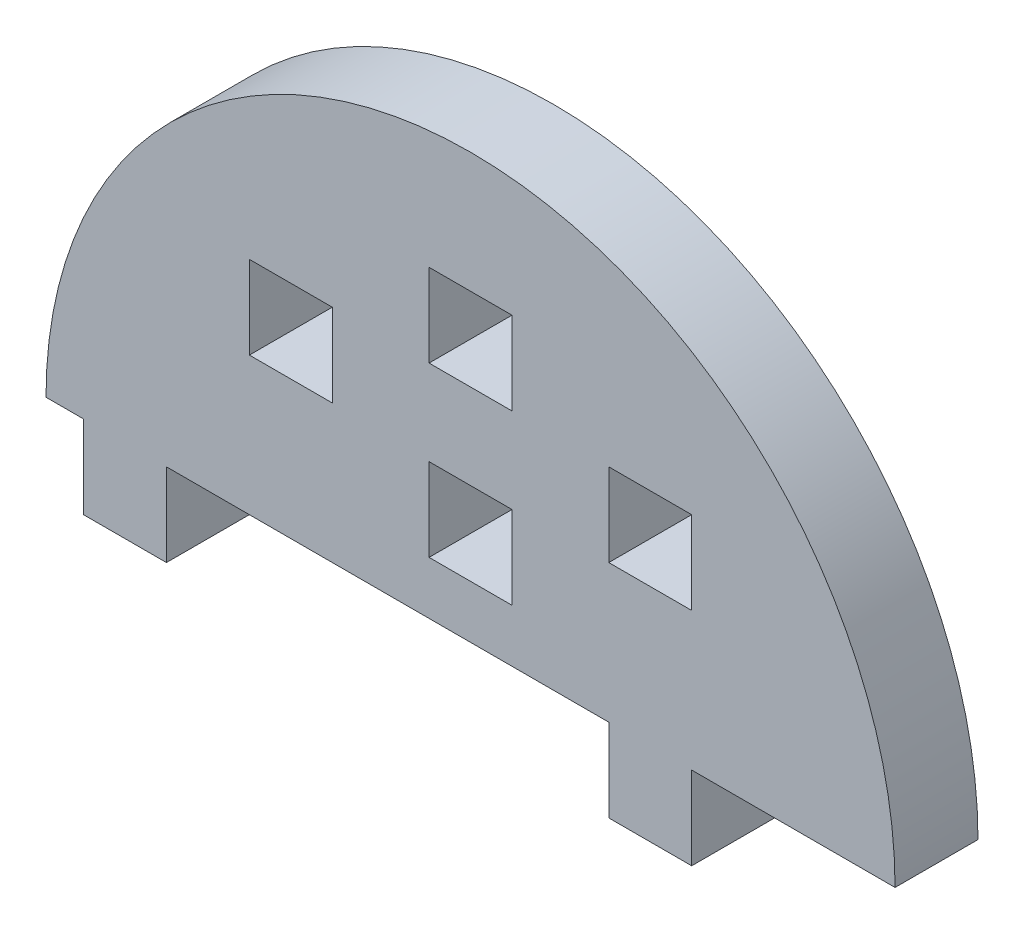
ISO-10303-21;
HEADER;
FILE_DESCRIPTION(('STEP AP214'),'2;1');
FILE_NAME('part.step','',(''),(''),'','','');
FILE_SCHEMA(('AUTOMOTIVE_DESIGN { 1 0 10303 214 1 1 1 1 }'));
ENDSEC;
DATA;
#1=APPLICATION_CONTEXT('core data for automotive mechanical design processes');
#2=APPLICATION_PROTOCOL_DEFINITION('international standard','automotive_design',2000,#1);
#3=PRODUCT_CONTEXT('',#1,'mechanical');
#4=PRODUCT('Part','Part','',(#3));
#5=PRODUCT_RELATED_PRODUCT_CATEGORY('part','',(#4));
#6=PRODUCT_DEFINITION_FORMATION('','',#4);
#7=PRODUCT_DEFINITION_CONTEXT('part definition',#1,'design');
#8=PRODUCT_DEFINITION('design','',#6,#7);
#9=PRODUCT_DEFINITION_SHAPE('','',#8);
#10=(LENGTH_UNIT() NAMED_UNIT(*) SI_UNIT(.MILLI.,.METRE.));
#11=(NAMED_UNIT(*) PLANE_ANGLE_UNIT() SI_UNIT($,.RADIAN.));
#12=(NAMED_UNIT(*) SI_UNIT($,.STERADIAN.) SOLID_ANGLE_UNIT());
#13=UNCERTAINTY_MEASURE_WITH_UNIT(LENGTH_MEASURE(1.E-05),#10,'distance_accuracy_value','');
#14=(GEOMETRIC_REPRESENTATION_CONTEXT(3) GLOBAL_UNCERTAINTY_ASSIGNED_CONTEXT((#13)) GLOBAL_UNIT_ASSIGNED_CONTEXT((#10,
#11,#12)) REPRESENTATION_CONTEXT('',''));
#15=CARTESIAN_POINT('',(0.,0.,0.));
#16=DIRECTION('',(0.,0.,1.));
#17=DIRECTION('',(1.,0.,0.));
#18=AXIS2_PLACEMENT_3D('',#15,#16,#17);
#19=CARTESIAN_POINT('',(3671.8002761947,1334.92871189316,6.));
#20=DIRECTION('',(0.,0.,1.));
#21=DIRECTION('',(1.,0.,0.));
#22=AXIS2_PLACEMENT_3D('',#19,#20,#21);
#23=PLANE('',#22);
#24=DIRECTION('',(0.,1.,0.));
#25=VECTOR('',#24,1.);
#26=CARTESIAN_POINT('',(3681.8002761947,0.,6.));
#27=LINE('',#26,#25);
#28=CARTESIAN_POINT('',(3681.8002761947,1344.92871189316,6.));
#29=VERTEX_POINT('',#28);
#30=CARTESIAN_POINT('',(3681.8002761947,1350.92871189316,6.));
#31=VERTEX_POINT('',#30);
#32=EDGE_CURVE('E393',#29,#31,#27,.T.);
#33=ORIENTED_EDGE('',*,*,#32,.T.);
#34=DIRECTION('',(1.,0.,0.));
#35=VECTOR('',#34,1.);
#36=CARTESIAN_POINT('',(0.,1350.92871189316,6.));
#37=LINE('',#36,#35);
#38=CARTESIAN_POINT('',(3687.8002761947,1350.92871189316,6.));
#39=VERTEX_POINT('',#38);
#40=EDGE_CURVE('E406',#31,#39,#37,.T.);
#41=ORIENTED_EDGE('',*,*,#40,.T.);
#42=DIRECTION('',(0.,-1.,0.));
#43=VECTOR('',#42,1.);
#44=CARTESIAN_POINT('',(3687.8002761947,0.,6.));
#45=LINE('',#44,#43);
#46=CARTESIAN_POINT('',(3687.8002761947,1344.92871189316,6.));
#47=VERTEX_POINT('',#46);
#48=EDGE_CURVE('E223',#39,#47,#45,.T.);
#49=ORIENTED_EDGE('',*,*,#48,.T.);
#50=DIRECTION('',(-1.,0.,0.));
#51=VECTOR('',#50,1.);
#52=CARTESIAN_POINT('',(0.,1344.92871189316,6.));
#53=LINE('',#52,#51);
#54=EDGE_CURVE('E385',#47,#29,#53,.T.);
#55=ORIENTED_EDGE('',*,*,#54,.T.);
#56=EDGE_LOOP('',(#33,#41,#49,#55));
#57=FACE_BOUND('',#56,.T.);
#58=DIRECTION('',(0.,1.,0.));
#59=VECTOR('',#58,1.);
#60=CARTESIAN_POINT('',(3668.8002761947,0.,6.));
#61=LINE('',#60,#59);
#62=CARTESIAN_POINT('',(3668.8002761947,1350.92871189316,6.));
#63=VERTEX_POINT('',#62);
#64=CARTESIAN_POINT('',(3668.8002761947,1356.92871189316,6.));
#65=VERTEX_POINT('',#64);
#66=EDGE_CURVE('E472',#63,#65,#61,.T.);
#67=ORIENTED_EDGE('',*,*,#66,.T.);
#68=DIRECTION('',(1.,0.,0.));
#69=VECTOR('',#68,1.);
#70=CARTESIAN_POINT('',(0.,1356.92871189316,6.));
#71=LINE('',#70,#69);
#72=CARTESIAN_POINT('',(3674.8002761947,1356.92871189316,6.));
#73=VERTEX_POINT('',#72);
#74=EDGE_CURVE('E485',#65,#73,#71,.T.);
#75=ORIENTED_EDGE('',*,*,#74,.T.);
#76=DIRECTION('',(0.,-1.,0.));
#77=VECTOR('',#76,1.);
#78=CARTESIAN_POINT('',(3674.8002761947,0.,6.));
#79=LINE('',#78,#77);
#80=CARTESIAN_POINT('',(3674.8002761947,1350.92871189316,6.));
#81=VERTEX_POINT('',#80);
#82=EDGE_CURVE('E481',#73,#81,#79,.T.);
#83=ORIENTED_EDGE('',*,*,#82,.T.);
#84=DIRECTION('',(-1.,0.,0.));
#85=VECTOR('',#84,1.);
#86=CARTESIAN_POINT('',(0.,1350.92871189316,6.));
#87=LINE('',#86,#85);
#88=EDGE_CURVE('E476',#81,#63,#87,.T.);
#89=ORIENTED_EDGE('',*,*,#88,.T.);
#90=EDGE_LOOP('',(#67,#75,#83,#89));
#91=FACE_BOUND('',#90,.T.);
#92=DIRECTION('',(1.,0.,0.));
#93=VECTOR('',#92,1.);
#94=CARTESIAN_POINT('',(3687.8002761947,1334.92871189316,6.));
#95=LINE('',#94,#93);
#96=CARTESIAN_POINT('',(3687.8002761947,1334.92871189316,6.));
#97=VERTEX_POINT('',#96);
#98=CARTESIAN_POINT('',(3702.51456190899,1334.92871189316,6.));
#99=VERTEX_POINT('',#98);
#100=EDGE_CURVE('E559',#97,#99,#95,.T.);
#101=ORIENTED_EDGE('',*,*,#100,.T.);
#102=CARTESIAN_POINT('',(3671.8002761947,1334.92871189316,6.));
#103=DIRECTION('',(0.,0.,1.));
#104=DIRECTION('',(1.,0.,0.));
#105=AXIS2_PLACEMENT_3D('',#102,#103,#104);
#106=CIRCLE('',#105,30.7142857142879);
#107=CARTESIAN_POINT('',(3641.08599048041,1334.92871189316,6.));
#108=VERTEX_POINT('',#107);
#109=EDGE_CURVE('E563',#99,#108,#106,.T.);
#110=ORIENTED_EDGE('',*,*,#109,.T.);
#111=DIRECTION('',(1.,0.,0.));
#112=VECTOR('',#111,1.);
#113=CARTESIAN_POINT('',(3641.08599048041,1334.92871189316,6.));
#114=LINE('',#113,#112);
#115=CARTESIAN_POINT('',(3643.8002761947,1334.92871189316,6.));
#116=VERTEX_POINT('',#115);
#117=EDGE_CURVE('E567',#108,#116,#114,.T.);
#118=ORIENTED_EDGE('',*,*,#117,.T.);
#119=DIRECTION('',(0.,1.,0.));
#120=VECTOR('',#119,1.);
#121=CARTESIAN_POINT('',(3643.8002761947,1328.92871189316,6.));
#122=LINE('',#121,#120);
#123=CARTESIAN_POINT('',(3643.8002761947,1328.92871189316,6.));
#124=VERTEX_POINT('',#123);
#125=EDGE_CURVE('E570',#124,#116,#122,.T.);
#126=ORIENTED_EDGE('',*,*,#125,.F.);
#127=DIRECTION('',(-1.,0.,0.));
#128=VECTOR('',#127,1.);
#129=CARTESIAN_POINT('',(3649.8002761947,1328.92871189316,6.));
#130=LINE('',#129,#128);
#131=CARTESIAN_POINT('',(3649.8002761947,1328.92871189316,6.));
#132=VERTEX_POINT('',#131);
#133=EDGE_CURVE('E574',#132,#124,#130,.T.);
#134=ORIENTED_EDGE('',*,*,#133,.F.);
#135=DIRECTION('',(0.,-1.,0.));
#136=VECTOR('',#135,1.);
#137=CARTESIAN_POINT('',(3649.8002761947,1334.92871189316,6.));
#138=LINE('',#137,#136);
#139=CARTESIAN_POINT('',(3649.8002761947,1334.92871189316,6.));
#140=VERTEX_POINT('',#139);
#141=EDGE_CURVE('E578',#140,#132,#138,.T.);
#142=ORIENTED_EDGE('',*,*,#141,.F.);
#143=DIRECTION('',(1.,0.,0.));
#144=VECTOR('',#143,1.);
#145=CARTESIAN_POINT('',(3649.8002761947,1334.92871189316,6.));
#146=LINE('',#145,#144);
#147=CARTESIAN_POINT('',(3681.8002761947,1334.92871189316,6.));
#148=VERTEX_POINT('',#147);
#149=EDGE_CURVE('E582',#140,#148,#146,.T.);
#150=ORIENTED_EDGE('',*,*,#149,.T.);
#151=DIRECTION('',(0.,-1.,0.));
#152=VECTOR('',#151,1.);
#153=CARTESIAN_POINT('',(3681.8002761947,1334.92871189316,6.));
#154=LINE('',#153,#152);
#155=CARTESIAN_POINT('',(3681.8002761947,1328.92871189316,6.));
#156=VERTEX_POINT('',#155);
#157=EDGE_CURVE('E585',#148,#156,#154,.T.);
#158=ORIENTED_EDGE('',*,*,#157,.T.);
#159=DIRECTION('',(1.,0.,0.));
#160=VECTOR('',#159,1.);
#161=CARTESIAN_POINT('',(3681.8002761947,1328.92871189316,6.));
#162=LINE('',#161,#160);
#163=CARTESIAN_POINT('',(3687.8002761947,1328.92871189316,6.));
#164=VERTEX_POINT('',#163);
#165=EDGE_CURVE('E588',#156,#164,#162,.T.);
#166=ORIENTED_EDGE('',*,*,#165,.T.);
#167=DIRECTION('',(0.,1.,0.));
#168=VECTOR('',#167,1.);
#169=CARTESIAN_POINT('',(3687.8002761947,1328.92871189316,6.));
#170=LINE('',#169,#168);
#171=EDGE_CURVE('E591',#164,#97,#170,.T.);
#172=ORIENTED_EDGE('',*,*,#171,.T.);
#173=EDGE_LOOP('',(#101,#110,#118,#126,#134,#142,#150,#158,#166,#172));
#174=FACE_BOUND('',#173,.T.);
#175=DIRECTION('',(0.,1.,0.));
#176=VECTOR('',#175,1.);
#177=CARTESIAN_POINT('',(3661.8002761947,0.,6.));
#178=LINE('',#177,#176);
#179=CARTESIAN_POINT('',(3661.8002761947,1344.92871189316,6.));
#180=VERTEX_POINT('',#179);
#181=CARTESIAN_POINT('',(3661.8002761947,1350.92871189316,6.));
#182=VERTEX_POINT('',#181);
#183=EDGE_CURVE('E519',#180,#182,#178,.T.);
#184=ORIENTED_EDGE('',*,*,#183,.F.);
#185=DIRECTION('',(1.,0.,0.));
#186=VECTOR('',#185,1.);
#187=CARTESIAN_POINT('',(0.,1344.92871189316,6.));
#188=LINE('',#187,#186);
#189=CARTESIAN_POINT('',(3655.8002761947,1344.92871189316,6.));
#190=VERTEX_POINT('',#189);
#191=EDGE_CURVE('E516',#190,#180,#188,.T.);
#192=ORIENTED_EDGE('',*,*,#191,.F.);
#193=DIRECTION('',(0.,-1.,0.));
#194=VECTOR('',#193,1.);
#195=CARTESIAN_POINT('',(3655.8002761947,0.,6.));
#196=LINE('',#195,#194);
#197=CARTESIAN_POINT('',(3655.8002761947,1350.92871189316,6.));
#198=VERTEX_POINT('',#197);
#199=EDGE_CURVE('E527',#198,#190,#196,.T.);
#200=ORIENTED_EDGE('',*,*,#199,.F.);
#201=DIRECTION('',(-1.,0.,0.));
#202=VECTOR('',#201,1.);
#203=CARTESIAN_POINT('',(0.,1350.92871189316,6.));
#204=LINE('',#203,#202);
#205=EDGE_CURVE('E523',#182,#198,#204,.T.);
#206=ORIENTED_EDGE('',*,*,#205,.F.);
#207=EDGE_LOOP('',(#184,#192,#200,#206));
#208=FACE_BOUND('',#207,.T.);
#209=DIRECTION('',(0.,-1.,0.));
#210=VECTOR('',#209,1.);
#211=CARTESIAN_POINT('',(3668.8002761947,0.,6.));
#212=LINE('',#211,#210);
#213=CARTESIAN_POINT('',(3668.8002761947,1344.75317072658,6.));
#214=VERTEX_POINT('',#213);
#215=CARTESIAN_POINT('',(3668.8002761947,1338.75317072658,6.));
#216=VERTEX_POINT('',#215);
#217=EDGE_CURVE('E432',#214,#216,#212,.T.);
#218=ORIENTED_EDGE('',*,*,#217,.F.);
#219=DIRECTION('',(-1.,0.,0.));
#220=VECTOR('',#219,1.);
#221=CARTESIAN_POINT('',(0.,1344.75317072658,6.));
#222=LINE('',#221,#220);
#223=CARTESIAN_POINT('',(3674.8002761947,1344.75317072658,6.));
#224=VERTEX_POINT('',#223);
#225=EDGE_CURVE('E429',#224,#214,#222,.T.);
#226=ORIENTED_EDGE('',*,*,#225,.F.);
#227=DIRECTION('',(0.,1.,0.));
#228=VECTOR('',#227,1.);
#229=CARTESIAN_POINT('',(3674.8002761947,0.,6.));
#230=LINE('',#229,#228);
#231=CARTESIAN_POINT('',(3674.8002761947,1338.75317072658,6.));
#232=VERTEX_POINT('',#231);
#233=EDGE_CURVE('E440',#232,#224,#230,.T.);
#234=ORIENTED_EDGE('',*,*,#233,.F.);
#235=DIRECTION('',(1.,0.,0.));
#236=VECTOR('',#235,1.);
#237=CARTESIAN_POINT('',(0.,1338.75317072658,6.));
#238=LINE('',#237,#236);
#239=EDGE_CURVE('E436',#216,#232,#238,.T.);
#240=ORIENTED_EDGE('',*,*,#239,.F.);
#241=EDGE_LOOP('',(#218,#226,#234,#240));
#242=FACE_BOUND('',#241,.T.);
#243=ADVANCED_FACE('F207',(#57,#91,#174,#208,#242),#23,.T.);
#244=CARTESIAN_POINT('',(3671.8002761947,1334.92871189316,0.));
#245=DIRECTION('',(0.,0.,1.));
#246=DIRECTION('',(1.,0.,0.));
#247=AXIS2_PLACEMENT_3D('',#244,#245,#246);
#248=PLANE('',#247);
#249=DIRECTION('',(1.,0.,0.));
#250=VECTOR('',#249,1.);
#251=CARTESIAN_POINT('',(0.,1350.92871189316,0.));
#252=LINE('',#251,#250);
#253=CARTESIAN_POINT('',(3681.8002761947,1350.92871189316,0.));
#254=VERTEX_POINT('',#253);
#255=CARTESIAN_POINT('',(3687.8002761947,1350.92871189316,0.));
#256=VERTEX_POINT('',#255);
#257=EDGE_CURVE('E400',#254,#256,#252,.T.);
#258=ORIENTED_EDGE('',*,*,#257,.F.);
#259=DIRECTION('',(0.,1.,0.));
#260=VECTOR('',#259,1.);
#261=CARTESIAN_POINT('',(3681.8002761947,0.,0.));
#262=LINE('',#261,#260);
#263=CARTESIAN_POINT('',(3681.8002761947,1344.92871189316,0.));
#264=VERTEX_POINT('',#263);
#265=EDGE_CURVE('E231',#264,#254,#262,.T.);
#266=ORIENTED_EDGE('',*,*,#265,.F.);
#267=DIRECTION('',(-1.,0.,0.));
#268=VECTOR('',#267,1.);
#269=CARTESIAN_POINT('',(0.,1344.92871189316,0.));
#270=LINE('',#269,#268);
#271=CARTESIAN_POINT('',(3687.8002761947,1344.92871189316,0.));
#272=VERTEX_POINT('',#271);
#273=EDGE_CURVE('E387',#272,#264,#270,.T.);
#274=ORIENTED_EDGE('',*,*,#273,.F.);
#275=DIRECTION('',(0.,-1.,0.));
#276=VECTOR('',#275,1.);
#277=CARTESIAN_POINT('',(3687.8002761947,0.,0.));
#278=LINE('',#277,#276);
#279=EDGE_CURVE('E415',#256,#272,#278,.T.);
#280=ORIENTED_EDGE('',*,*,#279,.F.);
#281=EDGE_LOOP('',(#258,#266,#274,#280));
#282=FACE_BOUND('',#281,.T.);
#283=DIRECTION('',(1.,0.,0.));
#284=VECTOR('',#283,1.);
#285=CARTESIAN_POINT('',(0.,1344.92871189316,0.));
#286=LINE('',#285,#284);
#287=CARTESIAN_POINT('',(3655.8002761947,1344.92871189316,0.));
#288=VERTEX_POINT('',#287);
#289=CARTESIAN_POINT('',(3661.8002761947,1344.92871189316,0.));
#290=VERTEX_POINT('',#289);
#291=EDGE_CURVE('E515',#288,#290,#286,.T.);
#292=ORIENTED_EDGE('',*,*,#291,.T.);
#293=DIRECTION('',(0.,1.,0.));
#294=VECTOR('',#293,1.);
#295=CARTESIAN_POINT('',(3661.8002761947,0.,0.));
#296=LINE('',#295,#294);
#297=CARTESIAN_POINT('',(3661.8002761947,1350.92871189316,0.));
#298=VERTEX_POINT('',#297);
#299=EDGE_CURVE('E534',#290,#298,#296,.T.);
#300=ORIENTED_EDGE('',*,*,#299,.T.);
#301=DIRECTION('',(-1.,0.,0.));
#302=VECTOR('',#301,1.);
#303=CARTESIAN_POINT('',(0.,1350.92871189316,0.));
#304=LINE('',#303,#302);
#305=CARTESIAN_POINT('',(3655.8002761947,1350.92871189316,0.));
#306=VERTEX_POINT('',#305);
#307=EDGE_CURVE('E538',#298,#306,#304,.T.);
#308=ORIENTED_EDGE('',*,*,#307,.T.);
#309=DIRECTION('',(0.,-1.,0.));
#310=VECTOR('',#309,1.);
#311=CARTESIAN_POINT('',(3655.8002761947,0.,0.));
#312=LINE('',#311,#310);
#313=EDGE_CURVE('E520',#306,#288,#312,.T.);
#314=ORIENTED_EDGE('',*,*,#313,.T.);
#315=EDGE_LOOP('',(#292,#300,#308,#314));
#316=FACE_BOUND('',#315,.T.);
#317=DIRECTION('',(1.,0.,0.));
#318=VECTOR('',#317,1.);
#319=CARTESIAN_POINT('',(3687.8002761947,1334.92871189316,0.));
#320=LINE('',#319,#318);
#321=CARTESIAN_POINT('',(3687.8002761947,1334.92871189316,0.));
#322=VERTEX_POINT('',#321);
#323=CARTESIAN_POINT('',(3702.51456190899,1334.92871189316,0.));
#324=VERTEX_POINT('',#323);
#325=EDGE_CURVE('E558',#322,#324,#320,.T.);
#326=ORIENTED_EDGE('',*,*,#325,.F.);
#327=DIRECTION('',(0.,1.,0.));
#328=VECTOR('',#327,1.);
#329=CARTESIAN_POINT('',(3687.8002761947,1328.92871189316,0.));
#330=LINE('',#329,#328);
#331=CARTESIAN_POINT('',(3687.8002761947,1328.92871189316,0.));
#332=VERTEX_POINT('',#331);
#333=EDGE_CURVE('E564',#332,#322,#330,.T.);
#334=ORIENTED_EDGE('',*,*,#333,.F.);
#335=DIRECTION('',(1.,0.,0.));
#336=VECTOR('',#335,1.);
#337=CARTESIAN_POINT('',(3681.8002761947,1328.92871189316,0.));
#338=LINE('',#337,#336);
#339=CARTESIAN_POINT('',(3681.8002761947,1328.92871189316,0.));
#340=VERTEX_POINT('',#339);
#341=EDGE_CURVE('E623',#340,#332,#338,.T.);
#342=ORIENTED_EDGE('',*,*,#341,.F.);
#343=DIRECTION('',(0.,-1.,0.));
#344=VECTOR('',#343,1.);
#345=CARTESIAN_POINT('',(3681.8002761947,1334.92871189316,0.));
#346=LINE('',#345,#344);
#347=CARTESIAN_POINT('',(3681.8002761947,1334.92871189316,0.));
#348=VERTEX_POINT('',#347);
#349=EDGE_CURVE('E620',#348,#340,#346,.T.);
#350=ORIENTED_EDGE('',*,*,#349,.F.);
#351=DIRECTION('',(1.,0.,0.));
#352=VECTOR('',#351,1.);
#353=CARTESIAN_POINT('',(3649.8002761947,1334.92871189316,0.));
#354=LINE('',#353,#352);
#355=CARTESIAN_POINT('',(3649.8002761947,1334.92871189316,0.));
#356=VERTEX_POINT('',#355);
#357=EDGE_CURVE('E617',#356,#348,#354,.T.);
#358=ORIENTED_EDGE('',*,*,#357,.F.);
#359=DIRECTION('',(0.,-1.,0.));
#360=VECTOR('',#359,1.);
#361=CARTESIAN_POINT('',(3649.8002761947,1334.92871189316,0.));
#362=LINE('',#361,#360);
#363=CARTESIAN_POINT('',(3649.8002761947,1328.92871189316,0.));
#364=VERTEX_POINT('',#363);
#365=EDGE_CURVE('E613',#356,#364,#362,.T.);
#366=ORIENTED_EDGE('',*,*,#365,.T.);
#367=DIRECTION('',(-1.,0.,0.));
#368=VECTOR('',#367,1.);
#369=CARTESIAN_POINT('',(3649.8002761947,1328.92871189316,0.));
#370=LINE('',#369,#368);
#371=CARTESIAN_POINT('',(3643.8002761947,1328.92871189316,0.));
#372=VERTEX_POINT('',#371);
#373=EDGE_CURVE('E609',#364,#372,#370,.T.);
#374=ORIENTED_EDGE('',*,*,#373,.T.);
#375=DIRECTION('',(0.,1.,0.));
#376=VECTOR('',#375,1.);
#377=CARTESIAN_POINT('',(3643.8002761947,1328.92871189316,0.));
#378=LINE('',#377,#376);
#379=CARTESIAN_POINT('',(3643.8002761947,1334.92871189316,0.));
#380=VERTEX_POINT('',#379);
#381=EDGE_CURVE('E605',#372,#380,#378,.T.);
#382=ORIENTED_EDGE('',*,*,#381,.T.);
#383=DIRECTION('',(1.,0.,0.));
#384=VECTOR('',#383,1.);
#385=CARTESIAN_POINT('',(3641.08599048041,1334.92871189316,0.));
#386=LINE('',#385,#384);
#387=CARTESIAN_POINT('',(3641.08599048041,1334.92871189316,0.));
#388=VERTEX_POINT('',#387);
#389=EDGE_CURVE('E601',#388,#380,#386,.T.);
#390=ORIENTED_EDGE('',*,*,#389,.F.);
#391=CARTESIAN_POINT('',(3671.8002761947,1334.92871189316,0.));
#392=DIRECTION('',(0.,0.,1.));
#393=DIRECTION('',(1.,0.,0.));
#394=AXIS2_PLACEMENT_3D('',#391,#392,#393);
#395=CIRCLE('',#394,30.7142857142879);
#396=EDGE_CURVE('E598',#324,#388,#395,.T.);
#397=ORIENTED_EDGE('',*,*,#396,.F.);
#398=EDGE_LOOP('',(#326,#334,#342,#350,#358,#366,#374,#382,#390,#397));
#399=FACE_BOUND('',#398,.T.);
#400=DIRECTION('',(1.,0.,0.));
#401=VECTOR('',#400,1.);
#402=CARTESIAN_POINT('',(0.,1356.92871189316,0.));
#403=LINE('',#402,#401);
#404=CARTESIAN_POINT('',(3668.8002761947,1356.92871189316,0.));
#405=VERTEX_POINT('',#404);
#406=CARTESIAN_POINT('',(3674.8002761947,1356.92871189316,0.));
#407=VERTEX_POINT('',#406);
#408=EDGE_CURVE('E477',#405,#407,#403,.T.);
#409=ORIENTED_EDGE('',*,*,#408,.F.);
#410=DIRECTION('',(0.,1.,0.));
#411=VECTOR('',#410,1.);
#412=CARTESIAN_POINT('',(3668.8002761947,0.,0.));
#413=LINE('',#412,#411);
#414=CARTESIAN_POINT('',(3668.8002761947,1350.92871189316,0.));
#415=VERTEX_POINT('',#414);
#416=EDGE_CURVE('E471',#415,#405,#413,.T.);
#417=ORIENTED_EDGE('',*,*,#416,.F.);
#418=DIRECTION('',(-1.,0.,0.));
#419=VECTOR('',#418,1.);
#420=CARTESIAN_POINT('',(0.,1350.92871189316,0.));
#421=LINE('',#420,#419);
#422=CARTESIAN_POINT('',(3674.8002761947,1350.92871189316,0.));
#423=VERTEX_POINT('',#422);
#424=EDGE_CURVE('E492',#423,#415,#421,.T.);
#425=ORIENTED_EDGE('',*,*,#424,.F.);
#426=DIRECTION('',(0.,-1.,0.));
#427=VECTOR('',#426,1.);
#428=CARTESIAN_POINT('',(3674.8002761947,0.,0.));
#429=LINE('',#428,#427);
#430=EDGE_CURVE('E496',#407,#423,#429,.T.);
#431=ORIENTED_EDGE('',*,*,#430,.F.);
#432=EDGE_LOOP('',(#409,#417,#425,#431));
#433=FACE_BOUND('',#432,.T.);
#434=DIRECTION('',(-1.,0.,0.));
#435=VECTOR('',#434,1.);
#436=CARTESIAN_POINT('',(0.,1344.75317072658,0.));
#437=LINE('',#436,#435);
#438=CARTESIAN_POINT('',(3674.8002761947,1344.75317072658,0.));
#439=VERTEX_POINT('',#438);
#440=CARTESIAN_POINT('',(3668.8002761947,1344.75317072658,0.));
#441=VERTEX_POINT('',#440);
#442=EDGE_CURVE('E389',#439,#441,#437,.T.);
#443=ORIENTED_EDGE('',*,*,#442,.T.);
#444=DIRECTION('',(0.,-1.,0.));
#445=VECTOR('',#444,1.);
#446=CARTESIAN_POINT('',(3668.8002761947,0.,0.));
#447=LINE('',#446,#445);
#448=CARTESIAN_POINT('',(3668.8002761947,1338.75317072658,0.));
#449=VERTEX_POINT('',#448);
#450=EDGE_CURVE('E447',#441,#449,#447,.T.);
#451=ORIENTED_EDGE('',*,*,#450,.T.);
#452=DIRECTION('',(1.,0.,0.));
#453=VECTOR('',#452,1.);
#454=CARTESIAN_POINT('',(0.,1338.75317072658,0.));
#455=LINE('',#454,#453);
#456=CARTESIAN_POINT('',(3674.8002761947,1338.75317072658,0.));
#457=VERTEX_POINT('',#456);
#458=EDGE_CURVE('E451',#449,#457,#455,.T.);
#459=ORIENTED_EDGE('',*,*,#458,.T.);
#460=DIRECTION('',(0.,1.,0.));
#461=VECTOR('',#460,1.);
#462=CARTESIAN_POINT('',(3674.8002761947,0.,0.));
#463=LINE('',#462,#461);
#464=EDGE_CURVE('E433',#457,#439,#463,.T.);
#465=ORIENTED_EDGE('',*,*,#464,.T.);
#466=EDGE_LOOP('',(#443,#451,#459,#465));
#467=FACE_BOUND('',#466,.T.);
#468=ADVANCED_FACE('F665',(#282,#316,#399,#433,#467),#248,.F.);
#469=CARTESIAN_POINT('',(3687.8002761947,1334.92871189316,6.));
#470=DIRECTION('',(0.,1.,0.));
#471=DIRECTION('',(0.,0.,1.));
#472=AXIS2_PLACEMENT_3D('',#469,#470,#471);
#473=PLANE('',#472);
#474=ORIENTED_EDGE('',*,*,#325,.T.);
#475=DIRECTION('',(0.,0.,-1.));
#476=VECTOR('',#475,1.);
#477=CARTESIAN_POINT('',(3702.51456190899,1334.92871189316,6.));
#478=LINE('',#477,#476);
#479=EDGE_CURVE('E12',#99,#324,#478,.T.);
#480=ORIENTED_EDGE('',*,*,#479,.F.);
#481=ORIENTED_EDGE('',*,*,#100,.F.);
#482=DIRECTION('',(0.,0.,-1.));
#483=VECTOR('',#482,1.);
#484=CARTESIAN_POINT('',(3687.8002761947,1334.92871189316,6.));
#485=LINE('',#484,#483);
#486=EDGE_CURVE('E594',#97,#322,#485,.T.);
#487=ORIENTED_EDGE('',*,*,#486,.T.);
#488=EDGE_LOOP('',(#474,#480,#481,#487));
#489=FACE_BOUND('',#488,.T.);
#490=ADVANCED_FACE('F209',(#489),#473,.F.);
#491=CARTESIAN_POINT('',(3671.8002761947,1334.92871189316,6.));
#492=DIRECTION('',(0.,0.,-1.));
#493=DIRECTION('',(-1.,0.,0.));
#494=AXIS2_PLACEMENT_3D('',#491,#492,#493);
#495=CYLINDRICAL_SURFACE('',#494,30.7142857142879);
#496=ORIENTED_EDGE('',*,*,#396,.T.);
#497=DIRECTION('',(0.,0.,-1.));
#498=VECTOR('',#497,1.);
#499=CARTESIAN_POINT('',(3641.08599048041,1334.92871189316,6.));
#500=LINE('',#499,#498);
#501=EDGE_CURVE('E216',#108,#388,#500,.T.);
#502=ORIENTED_EDGE('',*,*,#501,.F.);
#503=ORIENTED_EDGE('',*,*,#109,.F.);
#504=ORIENTED_EDGE('',*,*,#479,.T.);
#505=EDGE_LOOP('',(#496,#502,#503,#504));
#506=FACE_BOUND('',#505,.T.);
#507=ADVANCED_FACE('F704',(#506),#495,.T.);
#508=CARTESIAN_POINT('',(3641.08599048041,1334.92871189316,6.));
#509=DIRECTION('',(0.,1.,0.));
#510=DIRECTION('',(0.,0.,1.));
#511=AXIS2_PLACEMENT_3D('',#508,#509,#510);
#512=PLANE('',#511);
#513=ORIENTED_EDGE('',*,*,#389,.T.);
#514=DIRECTION('',(0.,0.,-1.));
#515=VECTOR('',#514,1.);
#516=CARTESIAN_POINT('',(3643.8002761947,1334.92871189316,6.));
#517=LINE('',#516,#515);
#518=EDGE_CURVE('E652',#116,#380,#517,.T.);
#519=ORIENTED_EDGE('',*,*,#518,.F.);
#520=ORIENTED_EDGE('',*,*,#117,.F.);
#521=ORIENTED_EDGE('',*,*,#501,.T.);
#522=EDGE_LOOP('',(#513,#519,#520,#521));
#523=FACE_BOUND('',#522,.T.);
#524=ADVANCED_FACE('F660',(#523),#512,.F.);
#525=CARTESIAN_POINT('',(3643.8002761947,1328.92871189316,6.));
#526=DIRECTION('',(-1.,0.,0.));
#527=DIRECTION('',(0.,0.,1.));
#528=AXIS2_PLACEMENT_3D('',#525,#526,#527);
#529=PLANE('',#528);
#530=ORIENTED_EDGE('',*,*,#381,.F.);
#531=DIRECTION('',(0.,0.,-1.));
#532=VECTOR('',#531,1.);
#533=CARTESIAN_POINT('',(3643.8002761947,1328.92871189316,6.));
#534=LINE('',#533,#532);
#535=EDGE_CURVE('E649',#124,#372,#534,.T.);
#536=ORIENTED_EDGE('',*,*,#535,.F.);
#537=ORIENTED_EDGE('',*,*,#125,.T.);
#538=ORIENTED_EDGE('',*,*,#518,.T.);
#539=EDGE_LOOP('',(#530,#536,#537,#538));
#540=FACE_BOUND('',#539,.T.);
#541=ADVANCED_FACE('F670',(#540),#529,.T.);
#542=CARTESIAN_POINT('',(3649.8002761947,1328.92871189316,6.));
#543=DIRECTION('',(0.,-1.,0.));
#544=DIRECTION('',(0.,0.,-1.));
#545=AXIS2_PLACEMENT_3D('',#542,#543,#544);
#546=PLANE('',#545);
#547=ORIENTED_EDGE('',*,*,#373,.F.);
#548=DIRECTION('',(0.,0.,-1.));
#549=VECTOR('',#548,1.);
#550=CARTESIAN_POINT('',(3649.8002761947,1328.92871189316,6.));
#551=LINE('',#550,#549);
#552=EDGE_CURVE('E646',#132,#364,#551,.T.);
#553=ORIENTED_EDGE('',*,*,#552,.F.);
#554=ORIENTED_EDGE('',*,*,#133,.T.);
#555=ORIENTED_EDGE('',*,*,#535,.T.);
#556=EDGE_LOOP('',(#547,#553,#554,#555));
#557=FACE_BOUND('',#556,.T.);
#558=ADVANCED_FACE('F677',(#557),#546,.T.);
#559=CARTESIAN_POINT('',(3649.8002761947,1334.92871189316,6.));
#560=DIRECTION('',(1.,0.,0.));
#561=DIRECTION('',(0.,0.,-1.));
#562=AXIS2_PLACEMENT_3D('',#559,#560,#561);
#563=PLANE('',#562);
#564=ORIENTED_EDGE('',*,*,#365,.F.);
#565=DIRECTION('',(0.,0.,-1.));
#566=VECTOR('',#565,1.);
#567=CARTESIAN_POINT('',(3649.8002761947,1334.92871189316,6.));
#568=LINE('',#567,#566);
#569=EDGE_CURVE('E643',#140,#356,#568,.T.);
#570=ORIENTED_EDGE('',*,*,#569,.F.);
#571=ORIENTED_EDGE('',*,*,#141,.T.);
#572=ORIENTED_EDGE('',*,*,#552,.T.);
#573=EDGE_LOOP('',(#564,#570,#571,#572));
#574=FACE_BOUND('',#573,.T.);
#575=ADVANCED_FACE('F680',(#574),#563,.T.);
#576=CARTESIAN_POINT('',(3649.8002761947,1334.92871189316,6.));
#577=DIRECTION('',(0.,1.,0.));
#578=DIRECTION('',(0.,0.,1.));
#579=AXIS2_PLACEMENT_3D('',#576,#577,#578);
#580=PLANE('',#579);
#581=ORIENTED_EDGE('',*,*,#357,.T.);
#582=DIRECTION('',(0.,0.,-1.));
#583=VECTOR('',#582,1.);
#584=CARTESIAN_POINT('',(3681.8002761947,1334.92871189316,6.));
#585=LINE('',#584,#583);
#586=EDGE_CURVE('E639',#148,#348,#585,.T.);
#587=ORIENTED_EDGE('',*,*,#586,.F.);
#588=ORIENTED_EDGE('',*,*,#149,.F.);
#589=ORIENTED_EDGE('',*,*,#569,.T.);
#590=EDGE_LOOP('',(#581,#587,#588,#589));
#591=FACE_BOUND('',#590,.T.);
#592=ADVANCED_FACE('F686',(#591),#580,.F.);
#593=CARTESIAN_POINT('',(3681.8002761947,1334.92871189316,6.));
#594=DIRECTION('',(1.,0.,0.));
#595=DIRECTION('',(0.,0.,-1.));
#596=AXIS2_PLACEMENT_3D('',#593,#594,#595);
#597=PLANE('',#596);
#598=ORIENTED_EDGE('',*,*,#349,.T.);
#599=DIRECTION('',(0.,0.,-1.));
#600=VECTOR('',#599,1.);
#601=CARTESIAN_POINT('',(3681.8002761947,1328.92871189316,6.));
#602=LINE('',#601,#600);
#603=EDGE_CURVE('E635',#156,#340,#602,.T.);
#604=ORIENTED_EDGE('',*,*,#603,.F.);
#605=ORIENTED_EDGE('',*,*,#157,.F.);
#606=ORIENTED_EDGE('',*,*,#586,.T.);
#607=EDGE_LOOP('',(#598,#604,#605,#606));
#608=FACE_BOUND('',#607,.T.);
#609=ADVANCED_FACE('F690',(#608),#597,.F.);
#610=CARTESIAN_POINT('',(3681.8002761947,1328.92871189316,6.));
#611=DIRECTION('',(0.,1.,0.));
#612=DIRECTION('',(0.,0.,1.));
#613=AXIS2_PLACEMENT_3D('',#610,#611,#612);
#614=PLANE('',#613);
#615=ORIENTED_EDGE('',*,*,#341,.T.);
#616=DIRECTION('',(0.,0.,-1.));
#617=VECTOR('',#616,1.);
#618=CARTESIAN_POINT('',(3687.8002761947,1328.92871189316,6.));
#619=LINE('',#618,#617);
#620=EDGE_CURVE('E631',#164,#332,#619,.T.);
#621=ORIENTED_EDGE('',*,*,#620,.F.);
#622=ORIENTED_EDGE('',*,*,#165,.F.);
#623=ORIENTED_EDGE('',*,*,#603,.T.);
#624=EDGE_LOOP('',(#615,#621,#622,#623));
#625=FACE_BOUND('',#624,.T.);
#626=ADVANCED_FACE('F695',(#625),#614,.F.);
#627=CARTESIAN_POINT('',(3687.8002761947,1328.92871189316,6.));
#628=DIRECTION('',(-1.,0.,0.));
#629=DIRECTION('',(0.,0.,1.));
#630=AXIS2_PLACEMENT_3D('',#627,#628,#629);
#631=PLANE('',#630);
#632=ORIENTED_EDGE('',*,*,#333,.T.);
#633=ORIENTED_EDGE('',*,*,#486,.F.);
#634=ORIENTED_EDGE('',*,*,#171,.F.);
#635=ORIENTED_EDGE('',*,*,#620,.T.);
#636=EDGE_LOOP('',(#632,#633,#634,#635));
#637=FACE_BOUND('',#636,.T.);
#638=ADVANCED_FACE('F701',(#637),#631,.F.);
#639=CARTESIAN_POINT('',(0.,1344.92871189316,6.));
#640=DIRECTION('',(0.,1.,0.));
#641=DIRECTION('',(0.,0.,1.));
#642=AXIS2_PLACEMENT_3D('',#639,#640,#641);
#643=PLANE('',#642);
#644=ORIENTED_EDGE('',*,*,#291,.F.);
#645=DIRECTION('',(0.,0.,-1.));
#646=VECTOR('',#645,1.);
#647=CARTESIAN_POINT('',(3655.8002761947,1344.92871189316,6.));
#648=LINE('',#647,#646);
#649=EDGE_CURVE('E530',#190,#288,#648,.T.);
#650=ORIENTED_EDGE('',*,*,#649,.F.);
#651=ORIENTED_EDGE('',*,*,#191,.T.);
#652=DIRECTION('',(0.,0.,-1.));
#653=VECTOR('',#652,1.);
#654=CARTESIAN_POINT('',(3661.8002761947,1344.92871189316,6.));
#655=LINE('',#654,#653);
#656=EDGE_CURVE('E554',#180,#290,#655,.T.);
#657=ORIENTED_EDGE('',*,*,#656,.T.);
#658=EDGE_LOOP('',(#644,#650,#651,#657));
#659=FACE_BOUND('',#658,.T.);
#660=ADVANCED_FACE('F719',(#659),#643,.T.);
#661=CARTESIAN_POINT('',(3661.8002761947,0.,6.));
#662=DIRECTION('',(-1.,0.,0.));
#663=DIRECTION('',(0.,0.,1.));
#664=AXIS2_PLACEMENT_3D('',#661,#662,#663);
#665=PLANE('',#664);
#666=ORIENTED_EDGE('',*,*,#299,.F.);
#667=ORIENTED_EDGE('',*,*,#656,.F.);
#668=ORIENTED_EDGE('',*,*,#183,.T.);
#669=DIRECTION('',(0.,0.,-1.));
#670=VECTOR('',#669,1.);
#671=CARTESIAN_POINT('',(3661.8002761947,1350.92871189316,6.));
#672=LINE('',#671,#670);
#673=EDGE_CURVE('E551',#182,#298,#672,.T.);
#674=ORIENTED_EDGE('',*,*,#673,.T.);
#675=EDGE_LOOP('',(#666,#667,#668,#674));
#676=FACE_BOUND('',#675,.T.);
#677=ADVANCED_FACE('F769',(#676),#665,.T.);
#678=CARTESIAN_POINT('',(0.,1350.92871189316,6.));
#679=DIRECTION('',(0.,-1.,0.));
#680=DIRECTION('',(0.,0.,-1.));
#681=AXIS2_PLACEMENT_3D('',#678,#679,#680);
#682=PLANE('',#681);
#683=ORIENTED_EDGE('',*,*,#307,.F.);
#684=ORIENTED_EDGE('',*,*,#673,.F.);
#685=ORIENTED_EDGE('',*,*,#205,.T.);
#686=DIRECTION('',(0.,0.,-1.));
#687=VECTOR('',#686,1.);
#688=CARTESIAN_POINT('',(3655.8002761947,1350.92871189316,6.));
#689=LINE('',#688,#687);
#690=EDGE_CURVE('E548',#198,#306,#689,.T.);
#691=ORIENTED_EDGE('',*,*,#690,.T.);
#692=EDGE_LOOP('',(#683,#684,#685,#691));
#693=FACE_BOUND('',#692,.T.);
#694=ADVANCED_FACE('F776',(#693),#682,.T.);
#695=CARTESIAN_POINT('',(3655.8002761947,0.,6.));
#696=DIRECTION('',(1.,0.,0.));
#697=DIRECTION('',(0.,0.,-1.));
#698=AXIS2_PLACEMENT_3D('',#695,#696,#697);
#699=PLANE('',#698);
#700=ORIENTED_EDGE('',*,*,#313,.F.);
#701=ORIENTED_EDGE('',*,*,#690,.F.);
#702=ORIENTED_EDGE('',*,*,#199,.T.);
#703=ORIENTED_EDGE('',*,*,#649,.T.);
#704=EDGE_LOOP('',(#700,#701,#702,#703));
#705=FACE_BOUND('',#704,.T.);
#706=ADVANCED_FACE('F783',(#705),#699,.T.);
#707=CARTESIAN_POINT('',(3668.8002761947,0.,6.));
#708=DIRECTION('',(-1.,0.,0.));
#709=DIRECTION('',(0.,0.,1.));
#710=AXIS2_PLACEMENT_3D('',#707,#708,#709);
#711=PLANE('',#710);
#712=ORIENTED_EDGE('',*,*,#416,.T.);
#713=DIRECTION('',(0.,0.,-1.));
#714=VECTOR('',#713,1.);
#715=CARTESIAN_POINT('',(3668.8002761947,1356.92871189316,6.));
#716=LINE('',#715,#714);
#717=EDGE_CURVE('E489',#65,#405,#716,.T.);
#718=ORIENTED_EDGE('',*,*,#717,.F.);
#719=ORIENTED_EDGE('',*,*,#66,.F.);
#720=DIRECTION('',(0.,0.,-1.));
#721=VECTOR('',#720,1.);
#722=CARTESIAN_POINT('',(3668.8002761947,1350.92871189316,6.));
#723=LINE('',#722,#721);
#724=EDGE_CURVE('E512',#63,#415,#723,.T.);
#725=ORIENTED_EDGE('',*,*,#724,.T.);
#726=EDGE_LOOP('',(#712,#718,#719,#725));
#727=FACE_BOUND('',#726,.T.);
#728=ADVANCED_FACE('F791',(#727),#711,.F.);
#729=CARTESIAN_POINT('',(0.,1350.92871189316,6.));
#730=DIRECTION('',(0.,-1.,0.));
#731=DIRECTION('',(0.,0.,-1.));
#732=AXIS2_PLACEMENT_3D('',#729,#730,#731);
#733=PLANE('',#732);
#734=ORIENTED_EDGE('',*,*,#424,.T.);
#735=ORIENTED_EDGE('',*,*,#724,.F.);
#736=ORIENTED_EDGE('',*,*,#88,.F.);
#737=DIRECTION('',(0.,0.,-1.));
#738=VECTOR('',#737,1.);
#739=CARTESIAN_POINT('',(3674.8002761947,1350.92871189316,6.));
#740=LINE('',#739,#738);
#741=EDGE_CURVE('E509',#81,#423,#740,.T.);
#742=ORIENTED_EDGE('',*,*,#741,.T.);
#743=EDGE_LOOP('',(#734,#735,#736,#742));
#744=FACE_BOUND('',#743,.T.);
#745=ADVANCED_FACE('F799',(#744),#733,.F.);
#746=CARTESIAN_POINT('',(3674.8002761947,0.,6.));
#747=DIRECTION('',(1.,0.,0.));
#748=DIRECTION('',(0.,0.,-1.));
#749=AXIS2_PLACEMENT_3D('',#746,#747,#748);
#750=PLANE('',#749);
#751=ORIENTED_EDGE('',*,*,#430,.T.);
#752=ORIENTED_EDGE('',*,*,#741,.F.);
#753=ORIENTED_EDGE('',*,*,#82,.F.);
#754=DIRECTION('',(0.,0.,-1.));
#755=VECTOR('',#754,1.);
#756=CARTESIAN_POINT('',(3674.8002761947,1356.92871189316,6.));
#757=LINE('',#756,#755);
#758=EDGE_CURVE('E506',#73,#407,#757,.T.);
#759=ORIENTED_EDGE('',*,*,#758,.T.);
#760=EDGE_LOOP('',(#751,#752,#753,#759));
#761=FACE_BOUND('',#760,.T.);
#762=ADVANCED_FACE('F807',(#761),#750,.F.);
#763=CARTESIAN_POINT('',(0.,1356.92871189316,6.));
#764=DIRECTION('',(0.,1.,0.));
#765=DIRECTION('',(0.,0.,1.));
#766=AXIS2_PLACEMENT_3D('',#763,#764,#765);
#767=PLANE('',#766);
#768=ORIENTED_EDGE('',*,*,#408,.T.);
#769=ORIENTED_EDGE('',*,*,#758,.F.);
#770=ORIENTED_EDGE('',*,*,#74,.F.);
#771=ORIENTED_EDGE('',*,*,#717,.T.);
#772=EDGE_LOOP('',(#768,#769,#770,#771));
#773=FACE_BOUND('',#772,.T.);
#774=ADVANCED_FACE('F815',(#773),#767,.F.);
#775=CARTESIAN_POINT('',(0.,1344.75317072658,6.));
#776=DIRECTION('',(0.,-1.,0.));
#777=DIRECTION('',(0.,0.,-1.));
#778=AXIS2_PLACEMENT_3D('',#775,#776,#777);
#779=PLANE('',#778);
#780=ORIENTED_EDGE('',*,*,#442,.F.);
#781=DIRECTION('',(0.,0.,-1.));
#782=VECTOR('',#781,1.);
#783=CARTESIAN_POINT('',(3674.8002761947,1344.75317072658,6.));
#784=LINE('',#783,#782);
#785=EDGE_CURVE('E443',#224,#439,#784,.T.);
#786=ORIENTED_EDGE('',*,*,#785,.F.);
#787=ORIENTED_EDGE('',*,*,#225,.T.);
#788=DIRECTION('',(0.,0.,-1.));
#789=VECTOR('',#788,1.);
#790=CARTESIAN_POINT('',(3668.8002761947,1344.75317072658,6.));
#791=LINE('',#790,#789);
#792=EDGE_CURVE('E467',#214,#441,#791,.T.);
#793=ORIENTED_EDGE('',*,*,#792,.T.);
#794=EDGE_LOOP('',(#780,#786,#787,#793));
#795=FACE_BOUND('',#794,.T.);
#796=ADVANCED_FACE('F823',(#795),#779,.T.);
#797=CARTESIAN_POINT('',(3668.8002761947,0.,6.));
#798=DIRECTION('',(1.,0.,0.));
#799=DIRECTION('',(0.,0.,-1.));
#800=AXIS2_PLACEMENT_3D('',#797,#798,#799);
#801=PLANE('',#800);
#802=ORIENTED_EDGE('',*,*,#450,.F.);
#803=ORIENTED_EDGE('',*,*,#792,.F.);
#804=ORIENTED_EDGE('',*,*,#217,.T.);
#805=DIRECTION('',(0.,0.,-1.));
#806=VECTOR('',#805,1.);
#807=CARTESIAN_POINT('',(3668.8002761947,1338.75317072658,6.));
#808=LINE('',#807,#806);
#809=EDGE_CURVE('E464',#216,#449,#808,.T.);
#810=ORIENTED_EDGE('',*,*,#809,.T.);
#811=EDGE_LOOP('',(#802,#803,#804,#810));
#812=FACE_BOUND('',#811,.T.);
#813=ADVANCED_FACE('F831',(#812),#801,.T.);
#814=CARTESIAN_POINT('',(0.,1338.75317072658,6.));
#815=DIRECTION('',(0.,1.,0.));
#816=DIRECTION('',(0.,0.,1.));
#817=AXIS2_PLACEMENT_3D('',#814,#815,#816);
#818=PLANE('',#817);
#819=ORIENTED_EDGE('',*,*,#458,.F.);
#820=ORIENTED_EDGE('',*,*,#809,.F.);
#821=ORIENTED_EDGE('',*,*,#239,.T.);
#822=DIRECTION('',(0.,0.,-1.));
#823=VECTOR('',#822,1.);
#824=CARTESIAN_POINT('',(3674.8002761947,1338.75317072658,6.));
#825=LINE('',#824,#823);
#826=EDGE_CURVE('E461',#232,#457,#825,.T.);
#827=ORIENTED_EDGE('',*,*,#826,.T.);
#828=EDGE_LOOP('',(#819,#820,#821,#827));
#829=FACE_BOUND('',#828,.T.);
#830=ADVANCED_FACE('F839',(#829),#818,.T.);
#831=CARTESIAN_POINT('',(3674.8002761947,0.,6.));
#832=DIRECTION('',(-1.,0.,0.));
#833=DIRECTION('',(0.,0.,1.));
#834=AXIS2_PLACEMENT_3D('',#831,#832,#833);
#835=PLANE('',#834);
#836=ORIENTED_EDGE('',*,*,#464,.F.);
#837=ORIENTED_EDGE('',*,*,#826,.F.);
#838=ORIENTED_EDGE('',*,*,#233,.T.);
#839=ORIENTED_EDGE('',*,*,#785,.T.);
#840=EDGE_LOOP('',(#836,#837,#838,#839));
#841=FACE_BOUND('',#840,.T.);
#842=ADVANCED_FACE('F847',(#841),#835,.T.);
#843=CARTESIAN_POINT('',(3681.8002761947,0.,6.));
#844=DIRECTION('',(-1.,0.,0.));
#845=DIRECTION('',(0.,0.,1.));
#846=AXIS2_PLACEMENT_3D('',#843,#844,#845);
#847=PLANE('',#846);
#848=ORIENTED_EDGE('',*,*,#265,.T.);
#849=DIRECTION('',(0.,0.,-1.));
#850=VECTOR('',#849,1.);
#851=CARTESIAN_POINT('',(3681.8002761947,1350.92871189316,6.));
#852=LINE('',#851,#850);
#853=EDGE_CURVE('E395',#31,#254,#852,.T.);
#854=ORIENTED_EDGE('',*,*,#853,.F.);
#855=ORIENTED_EDGE('',*,*,#32,.F.);
#856=DIRECTION('',(0.,0.,-1.));
#857=VECTOR('',#856,1.);
#858=CARTESIAN_POINT('',(3681.8002761947,1344.92871189316,6.));
#859=LINE('',#858,#857);
#860=EDGE_CURVE('E381',#29,#264,#859,.T.);
#861=ORIENTED_EDGE('',*,*,#860,.T.);
#862=EDGE_LOOP('',(#848,#854,#855,#861));
#863=FACE_BOUND('',#862,.T.);
#864=ADVANCED_FACE('F394',(#863),#847,.F.);
#865=CARTESIAN_POINT('',(0.,1344.92871189316,6.));
#866=DIRECTION('',(0.,-1.,0.));
#867=DIRECTION('',(0.,0.,-1.));
#868=AXIS2_PLACEMENT_3D('',#865,#866,#867);
#869=PLANE('',#868);
#870=ORIENTED_EDGE('',*,*,#273,.T.);
#871=ORIENTED_EDGE('',*,*,#860,.F.);
#872=ORIENTED_EDGE('',*,*,#54,.F.);
#873=DIRECTION('',(0.,0.,-1.));
#874=VECTOR('',#873,1.);
#875=CARTESIAN_POINT('',(3687.8002761947,1344.92871189316,6.));
#876=LINE('',#875,#874);
#877=EDGE_CURVE('E390',#47,#272,#876,.T.);
#878=ORIENTED_EDGE('',*,*,#877,.T.);
#879=EDGE_LOOP('',(#870,#871,#872,#878));
#880=FACE_BOUND('',#879,.T.);
#881=ADVANCED_FACE('F383',(#880),#869,.F.);
#882=CARTESIAN_POINT('',(3687.8002761947,0.,6.));
#883=DIRECTION('',(1.,0.,0.));
#884=DIRECTION('',(0.,0.,-1.));
#885=AXIS2_PLACEMENT_3D('',#882,#883,#884);
#886=PLANE('',#885);
#887=ORIENTED_EDGE('',*,*,#279,.T.);
#888=ORIENTED_EDGE('',*,*,#877,.F.);
#889=ORIENTED_EDGE('',*,*,#48,.F.);
#890=DIRECTION('',(0.,0.,-1.));
#891=VECTOR('',#890,1.);
#892=CARTESIAN_POINT('',(3687.8002761947,1350.92871189316,6.));
#893=LINE('',#892,#891);
#894=EDGE_CURVE('E424',#39,#256,#893,.T.);
#895=ORIENTED_EDGE('',*,*,#894,.T.);
#896=EDGE_LOOP('',(#887,#888,#889,#895));
#897=FACE_BOUND('',#896,.T.);
#898=ADVANCED_FACE('F868',(#897),#886,.F.);
#899=CARTESIAN_POINT('',(0.,1350.92871189316,6.));
#900=DIRECTION('',(0.,1.,0.));
#901=DIRECTION('',(0.,0.,1.));
#902=AXIS2_PLACEMENT_3D('',#899,#900,#901);
#903=PLANE('',#902);
#904=ORIENTED_EDGE('',*,*,#257,.T.);
#905=ORIENTED_EDGE('',*,*,#894,.F.);
#906=ORIENTED_EDGE('',*,*,#40,.F.);
#907=ORIENTED_EDGE('',*,*,#853,.T.);
#908=EDGE_LOOP('',(#904,#905,#906,#907));
#909=FACE_BOUND('',#908,.T.);
#910=ADVANCED_FACE('F875',(#909),#903,.F.);
#911=CLOSED_SHELL('',(#243,#468,#490,#507,#524,#541,#558,#575,#592,#609,#626,#638,#660,#677,
#694,#706,#728,#745,#762,#774,#796,#813,#830,#842,#864,#881,#898,#910));
#912=MANIFOLD_SOLID_BREP('B2',#911);
#913=ADVANCED_BREP_SHAPE_REPRESENTATION('',(#18,#912),#14);
#914=SHAPE_DEFINITION_REPRESENTATION(#9,#913);
ENDSEC;
END-ISO-10303-21;
